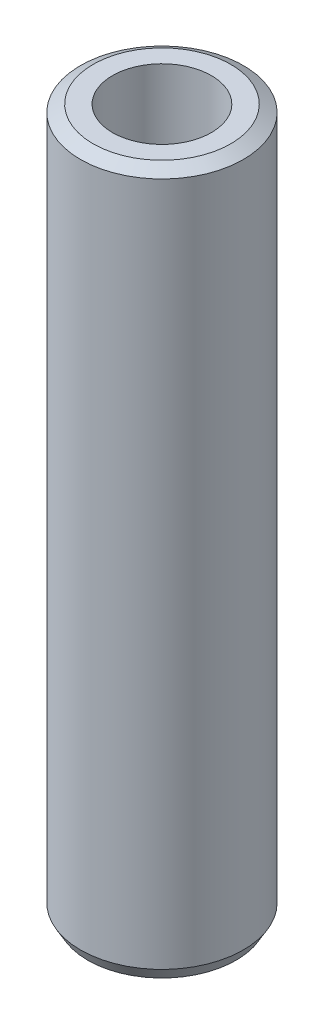
ISO-10303-21;
HEADER;
FILE_DESCRIPTION(('STEP AP214'),'2;1');
FILE_NAME('part.step','',(''),(''),'','','');
FILE_SCHEMA(('AUTOMOTIVE_DESIGN { 1 0 10303 214 1 1 1 1 }'));
ENDSEC;
DATA;
#1=APPLICATION_CONTEXT('core data for automotive mechanical design processes');
#2=APPLICATION_PROTOCOL_DEFINITION('international standard','automotive_design',2000,#1);
#3=PRODUCT_CONTEXT('',#1,'mechanical');
#4=PRODUCT('Part','Part','',(#3));
#5=PRODUCT_RELATED_PRODUCT_CATEGORY('part','',(#4));
#6=PRODUCT_DEFINITION_FORMATION('','',#4);
#7=PRODUCT_DEFINITION_CONTEXT('part definition',#1,'design');
#8=PRODUCT_DEFINITION('design','',#6,#7);
#9=PRODUCT_DEFINITION_SHAPE('','',#8);
#10=(LENGTH_UNIT() NAMED_UNIT(*) SI_UNIT(.MILLI.,.METRE.));
#11=(NAMED_UNIT(*) PLANE_ANGLE_UNIT() SI_UNIT($,.RADIAN.));
#12=(NAMED_UNIT(*) SI_UNIT($,.STERADIAN.) SOLID_ANGLE_UNIT());
#13=UNCERTAINTY_MEASURE_WITH_UNIT(LENGTH_MEASURE(1.E-05),#10,'distance_accuracy_value','');
#14=(GEOMETRIC_REPRESENTATION_CONTEXT(3) GLOBAL_UNCERTAINTY_ASSIGNED_CONTEXT((#13)) GLOBAL_UNIT_ASSIGNED_CONTEXT((#10,
#11,#12)) REPRESENTATION_CONTEXT('',''));
#15=CARTESIAN_POINT('',(0.,0.,0.));
#16=DIRECTION('',(0.,0.,1.));
#17=DIRECTION('',(1.,0.,0.));
#18=AXIS2_PLACEMENT_3D('',#15,#16,#17);
#19=CARTESIAN_POINT('',(0.,172.98543855336,0.));
#20=DIRECTION('',(0.,-1.,0.));
#21=DIRECTION('',(0.,0.,-1.));
#22=AXIS2_PLACEMENT_3D('',#19,#20,#21);
#23=CYLINDRICAL_SURFACE('',#22,20.);
#24=CARTESIAN_POINT('',(0.,171.197088081227,0.));
#25=DIRECTION('',(0.,1.,0.));
#26=DIRECTION('',(0.,0.,1.));
#27=AXIS2_PLACEMENT_3D('',#24,#25,#26);
#28=CIRCLE('',#27,20.);
#29=CARTESIAN_POINT('',(0.,171.197088081227,20.));
#30=VERTEX_POINT('',#29);
#31=EDGE_CURVE('E50',#30,#30,#28,.F.);
#32=ORIENTED_EDGE('',*,*,#31,.T.);
#33=EDGE_LOOP('',(#32));
#34=FACE_BOUND('',#33,.T.);
#35=CARTESIAN_POINT('',(0.,3.09751387947496,0.));
#36=DIRECTION('',(0.,1.,0.));
#37=DIRECTION('',(0.,0.,1.));
#38=AXIS2_PLACEMENT_3D('',#35,#36,#37);
#39=CIRCLE('',#38,20.);
#40=CARTESIAN_POINT('',(0.,3.09751387947496,20.));
#41=VERTEX_POINT('',#40);
#42=EDGE_CURVE('E51',#41,#41,#39,.T.);
#43=ORIENTED_EDGE('',*,*,#42,.T.);
#44=EDGE_LOOP('',(#43));
#45=FACE_BOUND('',#44,.T.);
#46=ADVANCED_FACE('F39',(#34,#45),#23,.T.);
#47=CARTESIAN_POINT('',(0.,172.98543855336,0.));
#48=DIRECTION('',(0.,1.,0.));
#49=DIRECTION('',(0.,0.,1.));
#50=AXIS2_PLACEMENT_3D('',#47,#48,#49);
#51=PLANE('',#50);
#52=CARTESIAN_POINT('',(0.,172.98543855336,0.));
#53=DIRECTION('',(0.,1.,0.));
#54=DIRECTION('',(0.,0.,1.));
#55=AXIS2_PLACEMENT_3D('',#52,#53,#54);
#56=CIRCLE('',#55,16.9024861205251);
#57=CARTESIAN_POINT('',(0.,172.98543855336,16.9024861205251));
#58=VERTEX_POINT('',#57);
#59=EDGE_CURVE('E54',#58,#58,#56,.T.);
#60=ORIENTED_EDGE('',*,*,#59,.T.);
#61=EDGE_LOOP('',(#60));
#62=FACE_BOUND('',#61,.T.);
#63=CARTESIAN_POINT('',(0.,172.98543855336,0.));
#64=DIRECTION('',(0.,1.,0.));
#65=DIRECTION('',(0.,0.,1.));
#66=AXIS2_PLACEMENT_3D('',#63,#64,#65);
#67=CIRCLE('',#66,12.1410099634182);
#68=CARTESIAN_POINT('',(0.,172.98543855336,12.1410099634182));
#69=VERTEX_POINT('',#68);
#70=EDGE_CURVE('E58',#69,#69,#67,.T.);
#71=ORIENTED_EDGE('',*,*,#70,.F.);
#72=EDGE_LOOP('',(#71));
#73=FACE_BOUND('',#72,.T.);
#74=ADVANCED_FACE('F69',(#62,#73),#51,.T.);
#75=CARTESIAN_POINT('',(0.,0.,0.));
#76=DIRECTION('',(0.,1.,0.));
#77=DIRECTION('',(0.,0.,1.));
#78=AXIS2_PLACEMENT_3D('',#75,#76,#77);
#79=PLANE('',#78);
#80=CARTESIAN_POINT('',(0.,0.,0.));
#81=DIRECTION('',(0.,1.,0.));
#82=DIRECTION('',(0.,0.,1.));
#83=AXIS2_PLACEMENT_3D('',#80,#81,#82);
#84=CIRCLE('',#83,18.2116495278665);
#85=CARTESIAN_POINT('',(0.,0.,18.2116495278665));
#86=VERTEX_POINT('',#85);
#87=EDGE_CURVE('E10',#86,#86,#84,.F.);
#88=ORIENTED_EDGE('',*,*,#87,.T.);
#89=EDGE_LOOP('',(#88));
#90=FACE_BOUND('',#89,.T.);
#91=CARTESIAN_POINT('',(0.,0.,0.));
#92=DIRECTION('',(0.,1.,0.));
#93=DIRECTION('',(0.,0.,1.));
#94=AXIS2_PLACEMENT_3D('',#91,#92,#93);
#95=CIRCLE('',#94,12.1410099634182);
#96=CARTESIAN_POINT('',(0.,0.,12.1410099634182));
#97=VERTEX_POINT('',#96);
#98=EDGE_CURVE('E63',#97,#97,#95,.T.);
#99=ORIENTED_EDGE('',*,*,#98,.T.);
#100=EDGE_LOOP('',(#99));
#101=FACE_BOUND('',#100,.T.);
#102=ADVANCED_FACE('F75',(#90,#101),#79,.F.);
#103=CARTESIAN_POINT('',(0.,172.98543855336,0.));
#104=DIRECTION('',(0.,-1.,0.));
#105=DIRECTION('',(0.,0.,-1.));
#106=AXIS2_PLACEMENT_3D('',#103,#104,#105);
#107=CYLINDRICAL_SURFACE('',#106,12.1410099634182);
#108=ORIENTED_EDGE('',*,*,#70,.T.);
#109=EDGE_LOOP('',(#108));
#110=FACE_BOUND('',#109,.T.);
#111=ORIENTED_EDGE('',*,*,#98,.F.);
#112=EDGE_LOOP('',(#111));
#113=FACE_BOUND('',#112,.T.);
#114=ADVANCED_FACE('F70',(#110,#113),#107,.F.);
#115=CARTESIAN_POINT('',(0.,172.98543855336,0.));
#116=DIRECTION('',(0.,-1.,0.));
#117=DIRECTION('',(0.,0.,-1.));
#118=AXIS2_PLACEMENT_3D('',#115,#116,#117);
#119=CONICAL_SURFACE('',#118,16.9024861205251,1.04719755119659);
#120=ORIENTED_EDGE('',*,*,#31,.F.);
#121=EDGE_LOOP('',(#120));
#122=FACE_BOUND('',#121,.T.);
#123=ORIENTED_EDGE('',*,*,#59,.F.);
#124=EDGE_LOOP('',(#123));
#125=FACE_BOUND('',#124,.T.);
#126=ADVANCED_FACE('F81',(#122,#125),#119,.T.);
#127=CARTESIAN_POINT('',(0.,3.09751387947496,0.));
#128=DIRECTION('',(0.,1.,0.));
#129=DIRECTION('',(0.,0.,1.));
#130=AXIS2_PLACEMENT_3D('',#127,#128,#129);
#131=CONICAL_SURFACE('',#130,20.,0.523598775598303);
#132=ORIENTED_EDGE('',*,*,#87,.F.);
#133=EDGE_LOOP('',(#132));
#134=FACE_BOUND('',#133,.T.);
#135=ORIENTED_EDGE('',*,*,#42,.F.);
#136=EDGE_LOOP('',(#135));
#137=FACE_BOUND('',#136,.T.);
#138=ADVANCED_FACE('F45',(#134,#137),#131,.T.);
#139=CLOSED_SHELL('',(#46,#74,#102,#114,#126,#138));
#140=MANIFOLD_SOLID_BREP('B2',#139);
#141=ADVANCED_BREP_SHAPE_REPRESENTATION('',(#18,#140),#14);
#142=SHAPE_DEFINITION_REPRESENTATION(#9,#141);
ENDSEC;
END-ISO-10303-21;
